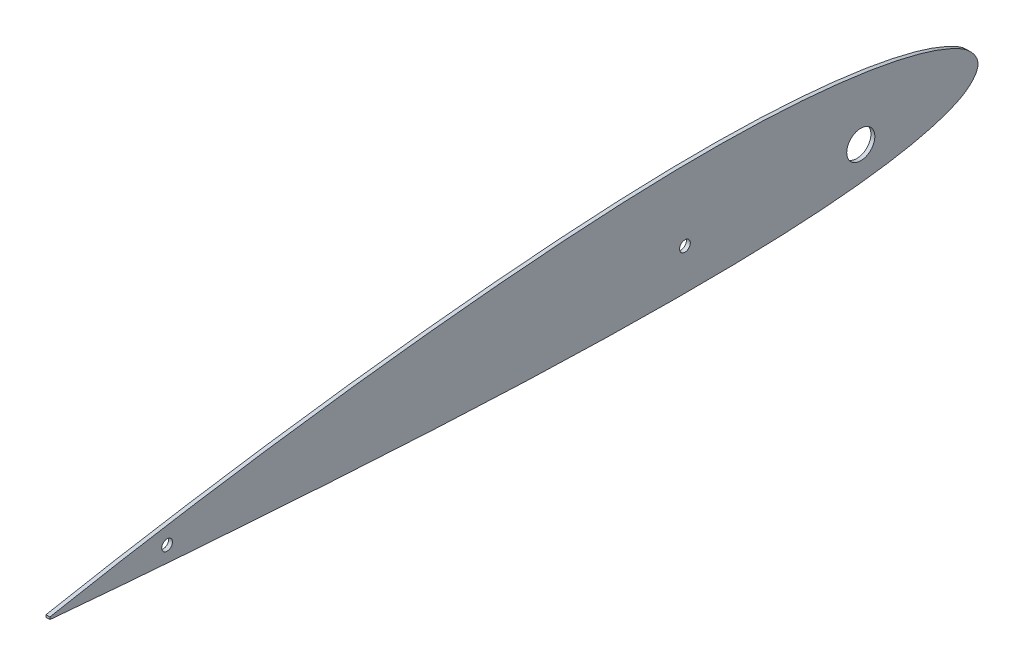
ISO-10303-21;
HEADER;
FILE_DESCRIPTION(('STEP AP214'),'2;1');
FILE_NAME('part.step','',(''),(''),'','','');
FILE_SCHEMA(('AUTOMOTIVE_DESIGN { 1 0 10303 214 1 1 1 1 }'));
ENDSEC;
DATA;
#1=APPLICATION_CONTEXT('core data for automotive mechanical design processes');
#2=APPLICATION_PROTOCOL_DEFINITION('international standard','automotive_design',2000,#1);
#3=PRODUCT_CONTEXT('',#1,'mechanical');
#4=PRODUCT('Part','Part','',(#3));
#5=PRODUCT_RELATED_PRODUCT_CATEGORY('part','',(#4));
#6=PRODUCT_DEFINITION_FORMATION('','',#4);
#7=PRODUCT_DEFINITION_CONTEXT('part definition',#1,'design');
#8=PRODUCT_DEFINITION('design','',#6,#7);
#9=PRODUCT_DEFINITION_SHAPE('','',#8);
#10=(LENGTH_UNIT() NAMED_UNIT(*) SI_UNIT(.MILLI.,.METRE.));
#11=(NAMED_UNIT(*) PLANE_ANGLE_UNIT() SI_UNIT($,.RADIAN.));
#12=(NAMED_UNIT(*) SI_UNIT($,.STERADIAN.) SOLID_ANGLE_UNIT());
#13=UNCERTAINTY_MEASURE_WITH_UNIT(LENGTH_MEASURE(1.E-05),#10,'distance_accuracy_value','');
#14=(GEOMETRIC_REPRESENTATION_CONTEXT(3) GLOBAL_UNCERTAINTY_ASSIGNED_CONTEXT((#13)) GLOBAL_UNIT_ASSIGNED_CONTEXT((#10,
#11,#12)) REPRESENTATION_CONTEXT('',''));
#15=CARTESIAN_POINT('',(0.,0.,0.));
#16=DIRECTION('',(0.,0.,1.));
#17=DIRECTION('',(1.,0.,0.));
#18=AXIS2_PLACEMENT_3D('',#15,#16,#17);
#19=CARTESIAN_POINT('',(2.,0.598497198061794,475.010074802855));
#20=CARTESIAN_POINT('',(2.,2.0790236287189,467.158690520784));
#21=CARTESIAN_POINT('',(2.,5.04046520752321,451.453860547719));
#22=CARTESIAN_POINT('',(2.,10.5303729676981,419.979582043477));
#23=CARTESIAN_POINT('',(2.,16.8373236789927,380.568519358802));
#24=CARTESIAN_POINT('',(2.,23.5016640304857,333.177066429499));
#25=CARTESIAN_POINT('',(2.,29.2721627629077,285.712995661429));
#26=CARTESIAN_POINT('',(2.,33.9707482150302,238.176447157113));
#27=CARTESIAN_POINT('',(2.,37.4185172913638,190.512569895496));
#28=CARTESIAN_POINT('',(2.,38.771778218813,150.679357097197));
#29=CARTESIAN_POINT('',(2.,38.4312492810106,118.758979212691));
#30=CARTESIAN_POINT('',(2.,37.3917675533514,94.8132002730884));
#31=CARTESIAN_POINT('',(2.,35.2890977949255,70.8709465141157));
#32=CARTESIAN_POINT('',(2.,32.4441637644638,50.9619868844845));
#33=CARTESIAN_POINT('',(2.,29.0608425273149,35.093906393071));
#34=CARTESIAN_POINT('',(2.,25.7786131745384,23.1483181376206));
#35=CARTESIAN_POINT('',(2.,21.7884828092321,13.1031754093609));
#36=CARTESIAN_POINT('',(2.,17.0044592579488,4.48816979284215));
#37=CARTESIAN_POINT('',(2.,7.90094705341297,-2.91234120427389));
#38=CARTESIAN_POINT('',(2.,-0.676100888636408,5.05216124977651));
#39=CARTESIAN_POINT('',(2.,-4.94658367346644,13.8832659371882));
#40=CARTESIAN_POINT('',(2.,-8.35498448423368,24.0571931578956));
#41=CARTESIAN_POINT('',(2.,-11.0298527935371,36.04230965412));
#42=CARTESIAN_POINT('',(2.,-13.6976980033518,51.8649255104538));
#43=CARTESIAN_POINT('',(2.,-15.8676272838065,71.6006452179179));
#44=CARTESIAN_POINT('',(2.,-17.4191085566015,95.2553331511756));
#45=CARTESIAN_POINT('',(2.,-18.2335362886324,118.863099098869));
#46=CARTESIAN_POINT('',(2.,-18.6213010186528,150.313877095147));
#47=CARTESIAN_POINT('',(2.,-18.1807835065514,189.707327800163));
#48=CARTESIAN_POINT('',(2.,-16.6534864273974,237.048964840664));
#49=CARTESIAN_POINT('',(2.,-14.3400470711003,284.501569815214));
#50=CARTESIAN_POINT('',(2.,-11.493536730421,332.013270591345));
#51=CARTESIAN_POINT('',(2.,-8.26585973787703,379.598404528134));
#52=CARTESIAN_POINT('',(2.,-5.27824397196585,419.295052652683));
#53=CARTESIAN_POINT('',(2.,-2.68922426390956,451.101430605551));
#54=CARTESIAN_POINT('',(2.,-1.29597982699712,467.020539675113));
#55=CARTESIAN_POINT('',(2.,-0.598497198061795,474.989925197145));
#56=B_SPLINE_CURVE_WITH_KNOTS('',3,(#19,#20,#21,#22,#23,#24,#25,#26,#27,#28,#29,#30,#31,#32,#33,
#34,#35,#36,#37,#38,#39,#40,#41,#42,#43,#44,#45,#46,#47,#48,#49,#50,#51,#52,#53,#54,#55),
.UNSPECIFIED.,.F.,.F.,(4,1,1,1,1,1,1,1,1,1,1,1,1,1,1,1,1,1,1,1,1,1,1,1,1,1,1,1,1,1,1,1,1,1,4),
(0.,0.0247583527022921,0.0495232057983208,0.099002464419805,0.148431640988793,0.197816092678823,
0.247156978041538,0.296440500967814,0.345884085447012,0.370605915917013,0.395346156344423,
0.420138805885135,0.4450560288657,0.457622030352105,0.470360866612067,0.483523326653886,
0.490626325383128,0.501772115898221,0.512907946738326,0.519977099804335,0.533052484339323,
0.545674076898575,0.558115541146016,0.58272509680566,0.607174358189599,0.631557278595084,
0.65591625667648,0.704636043070596,0.753621853029336,0.80268738739157,0.851851697592658,
0.901113053173649,0.950481472331415,0.975210155559022,1.),.UNSPECIFIED.);
#57=DIRECTION('',(-1.,0.,0.));
#58=VECTOR('',#57,1.);
#59=SURFACE_OF_LINEAR_EXTRUSION('',#56,#58);
#60=CARTESIAN_POINT('',(0.,0.598497198061794,475.010074802855));
#61=CARTESIAN_POINT('',(0.,2.0790236287189,467.158690520784));
#62=CARTESIAN_POINT('',(0.,5.04046520752321,451.453860547719));
#63=CARTESIAN_POINT('',(0.,10.5303729676981,419.979582043477));
#64=CARTESIAN_POINT('',(0.,16.8373236789927,380.568519358802));
#65=CARTESIAN_POINT('',(0.,23.5016640304857,333.177066429499));
#66=CARTESIAN_POINT('',(0.,29.2721627629077,285.712995661429));
#67=CARTESIAN_POINT('',(0.,33.9707482150302,238.176447157113));
#68=CARTESIAN_POINT('',(0.,37.4185172913638,190.512569895496));
#69=CARTESIAN_POINT('',(0.,38.771778218813,150.679357097197));
#70=CARTESIAN_POINT('',(0.,38.4312492810106,118.758979212691));
#71=CARTESIAN_POINT('',(0.,37.3917675533514,94.8132002730884));
#72=CARTESIAN_POINT('',(0.,35.2890977949255,70.8709465141157));
#73=CARTESIAN_POINT('',(0.,32.4441637644638,50.9619868844845));
#74=CARTESIAN_POINT('',(0.,29.0608425273149,35.093906393071));
#75=CARTESIAN_POINT('',(0.,25.7786131745384,23.1483181376206));
#76=CARTESIAN_POINT('',(0.,21.7884828092321,13.1031754093609));
#77=CARTESIAN_POINT('',(0.,17.0044592579488,4.48816979284215));
#78=CARTESIAN_POINT('',(0.,7.90094705341297,-2.91234120427389));
#79=CARTESIAN_POINT('',(0.,-0.676100888636408,5.05216124977651));
#80=CARTESIAN_POINT('',(0.,-4.94658367346644,13.8832659371882));
#81=CARTESIAN_POINT('',(0.,-8.35498448423368,24.0571931578956));
#82=CARTESIAN_POINT('',(0.,-11.0298527935371,36.04230965412));
#83=CARTESIAN_POINT('',(0.,-13.6976980033518,51.8649255104538));
#84=CARTESIAN_POINT('',(0.,-15.8676272838065,71.6006452179179));
#85=CARTESIAN_POINT('',(0.,-17.4191085566015,95.2553331511756));
#86=CARTESIAN_POINT('',(0.,-18.2335362886324,118.863099098869));
#87=CARTESIAN_POINT('',(0.,-18.6213010186528,150.313877095147));
#88=CARTESIAN_POINT('',(0.,-18.1807835065514,189.707327800163));
#89=CARTESIAN_POINT('',(0.,-16.6534864273974,237.048964840664));
#90=CARTESIAN_POINT('',(0.,-14.3400470711003,284.501569815214));
#91=CARTESIAN_POINT('',(0.,-11.493536730421,332.013270591345));
#92=CARTESIAN_POINT('',(0.,-8.26585973787703,379.598404528134));
#93=CARTESIAN_POINT('',(0.,-5.27824397196585,419.295052652683));
#94=CARTESIAN_POINT('',(0.,-2.68922426390956,451.101430605551));
#95=CARTESIAN_POINT('',(0.,-1.29597982699712,467.020539675113));
#96=CARTESIAN_POINT('',(0.,-0.598497198061795,474.989925197145));
#97=B_SPLINE_CURVE_WITH_KNOTS('',3,(#60,#61,#62,#63,#64,#65,#66,#67,#68,#69,#70,#71,#72,#73,#74,
#75,#76,#77,#78,#79,#80,#81,#82,#83,#84,#85,#86,#87,#88,#89,#90,#91,#92,#93,#94,#95,#96),
.UNSPECIFIED.,.F.,.F.,(4,1,1,1,1,1,1,1,1,1,1,1,1,1,1,1,1,1,1,1,1,1,1,1,1,1,1,1,1,1,1,1,1,1,4),
(0.,0.0247583527022921,0.0495232057983208,0.099002464419805,0.148431640988793,0.197816092678823,
0.247156978041538,0.296440500967814,0.345884085447012,0.370605915917013,0.395346156344423,
0.420138805885135,0.4450560288657,0.457622030352105,0.470360866612067,0.483523326653886,
0.490626325383128,0.501772115898221,0.512907946738326,0.519977099804335,0.533052484339323,
0.545674076898575,0.558115541146016,0.58272509680566,0.607174358189599,0.631557278595084,
0.65591625667648,0.704636043070596,0.753621853029336,0.80268738739157,0.851851697592658,
0.901113053173649,0.950481472331415,0.975210155559022,1.),.UNSPECIFIED.);
#98=CARTESIAN_POINT('',(0.,0.598497198061795,475.010074802855));
#99=VERTEX_POINT('',#98);
#100=CARTESIAN_POINT('',(0.,-0.598497198061795,474.989925197145));
#101=VERTEX_POINT('',#100);
#102=EDGE_CURVE('E67',#99,#101,#97,.T.);
#103=ORIENTED_EDGE('',*,*,#102,.F.);
#104=DIRECTION('',(-1.,0.,0.));
#105=VECTOR('',#104,1.);
#106=CARTESIAN_POINT('',(2.,0.598497198061795,475.010074802855));
#107=LINE('',#106,#105);
#108=CARTESIAN_POINT('',(2.,0.598497198061795,475.010074802855));
#109=VERTEX_POINT('',#108);
#110=EDGE_CURVE('E47',#109,#99,#107,.T.);
#111=ORIENTED_EDGE('',*,*,#110,.F.);
#112=CARTESIAN_POINT('',(2.,-0.598497198061795,474.989925197145));
#113=VERTEX_POINT('',#112);
#114=EDGE_CURVE('E68',#109,#113,#56,.T.);
#115=ORIENTED_EDGE('',*,*,#114,.T.);
#116=DIRECTION('',(-1.,0.,0.));
#117=VECTOR('',#116,1.);
#118=CARTESIAN_POINT('',(2.,-0.598497198061795,474.989925197145));
#119=LINE('',#118,#117);
#120=EDGE_CURVE('E11',#113,#101,#119,.T.);
#121=ORIENTED_EDGE('',*,*,#120,.T.);
#122=EDGE_LOOP('',(#103,#111,#115,#121));
#123=FACE_BOUND('',#122,.T.);
#124=ADVANCED_FACE('F37',(#123),#59,.T.);
#125=CARTESIAN_POINT('',(2.,0.598497198061795,475.010074802855));
#126=DIRECTION('',(0.,0.0168311159332721,-0.999858346735397));
#127=DIRECTION('',(0.,-0.999858346735397,-0.0168311159332722));
#128=AXIS2_PLACEMENT_3D('',#125,#126,#127);
#129=PLANE('',#128);
#130=DIRECTION('',(0.,0.999858346735397,0.0168311159332722));
#131=VECTOR('',#130,1.);
#132=CARTESIAN_POINT('',(0.,0.598497198061795,475.010074802855));
#133=LINE('',#132,#131);
#134=EDGE_CURVE('E62',#101,#99,#133,.T.);
#135=ORIENTED_EDGE('',*,*,#134,.F.);
#136=ORIENTED_EDGE('',*,*,#120,.F.);
#137=DIRECTION('',(0.,0.999858346735397,0.0168311159332722));
#138=VECTOR('',#137,1.);
#139=CARTESIAN_POINT('',(2.,0.598497198061795,475.010074802855));
#140=LINE('',#139,#138);
#141=EDGE_CURVE('E56',#113,#109,#140,.T.);
#142=ORIENTED_EDGE('',*,*,#141,.T.);
#143=ORIENTED_EDGE('',*,*,#110,.T.);
#144=EDGE_LOOP('',(#135,#136,#142,#143));
#145=FACE_BOUND('',#144,.T.);
#146=ADVANCED_FACE('F71',(#145),#129,.F.);
#147=CARTESIAN_POINT('',(2.,9.59888707137419,0.159864127170061));
#148=DIRECTION('',(-1.,0.,0.));
#149=DIRECTION('',(0.,0.,-1.));
#150=AXIS2_PLACEMENT_3D('',#147,#148,#149);
#151=PLANE('',#150);
#152=CARTESIAN_POINT('',(2.,2.5000018824215,60.));
#153=DIRECTION('',(-1.,0.,0.));
#154=DIRECTION('',(0.,0.,1.));
#155=AXIS2_PLACEMENT_3D('',#152,#153,#154);
#156=CIRCLE('',#155,7.19536101);
#157=CARTESIAN_POINT('',(2.,2.5000018824215,67.19536101));
#158=VERTEX_POINT('',#157);
#159=EDGE_CURVE('E87',#158,#158,#156,.T.);
#160=ORIENTED_EDGE('',*,*,#159,.T.);
#161=EDGE_LOOP('',(#160));
#162=FACE_BOUND('',#161,.T.);
#163=CARTESIAN_POINT('',(2.,2.5000018824215,150.));
#164=DIRECTION('',(-1.,0.,0.));
#165=DIRECTION('',(0.,0.,1.));
#166=AXIS2_PLACEMENT_3D('',#163,#164,#165);
#167=CIRCLE('',#166,2.75000000000001);
#168=CARTESIAN_POINT('',(2.,2.5000018824215,152.75));
#169=VERTEX_POINT('',#168);
#170=EDGE_CURVE('E101',#169,#169,#167,.T.);
#171=ORIENTED_EDGE('',*,*,#170,.T.);
#172=EDGE_LOOP('',(#171));
#173=FACE_BOUND('',#172,.T.);
#174=CARTESIAN_POINT('',(2.,2.50000188242148,415.033583382836));
#175=DIRECTION('',(-1.,0.,0.));
#176=DIRECTION('',(0.,0.,1.));
#177=AXIS2_PLACEMENT_3D('',#174,#175,#176);
#178=CIRCLE('',#177,2.75000000000004);
#179=CARTESIAN_POINT('',(2.,2.50000188242148,417.783583382836));
#180=VERTEX_POINT('',#179);
#181=EDGE_CURVE('E103',#180,#180,#178,.T.);
#182=ORIENTED_EDGE('',*,*,#181,.T.);
#183=EDGE_LOOP('',(#182));
#184=FACE_BOUND('',#183,.T.);
#185=ORIENTED_EDGE('',*,*,#114,.F.);
#186=ORIENTED_EDGE('',*,*,#141,.F.);
#187=EDGE_LOOP('',(#185,#186));
#188=FACE_BOUND('',#187,.T.);
#189=ADVANCED_FACE('F116',(#162,#173,#184,#188),#151,.F.);
#190=CARTESIAN_POINT('',(0.,9.59888707137419,0.159864127170061));
#191=DIRECTION('',(-1.,0.,0.));
#192=DIRECTION('',(0.,0.,-1.));
#193=AXIS2_PLACEMENT_3D('',#190,#191,#192);
#194=PLANE('',#193);
#195=CARTESIAN_POINT('',(0.,2.5000018824215,60.));
#196=DIRECTION('',(1.,0.,0.));
#197=DIRECTION('',(0.,0.,-1.));
#198=AXIS2_PLACEMENT_3D('',#195,#196,#197);
#199=CIRCLE('',#198,7.19536101);
#200=CARTESIAN_POINT('',(0.,2.5000018824215,67.19536101));
#201=VERTEX_POINT('',#200);
#202=EDGE_CURVE('E41',#201,#201,#199,.T.);
#203=ORIENTED_EDGE('',*,*,#202,.T.);
#204=EDGE_LOOP('',(#203));
#205=FACE_BOUND('',#204,.T.);
#206=CARTESIAN_POINT('',(0.,2.5000018824215,150.));
#207=DIRECTION('',(1.,0.,0.));
#208=DIRECTION('',(0.,0.,-1.));
#209=AXIS2_PLACEMENT_3D('',#206,#207,#208);
#210=CIRCLE('',#209,2.75000000000001);
#211=CARTESIAN_POINT('',(0.,2.5000018824215,152.75));
#212=VERTEX_POINT('',#211);
#213=EDGE_CURVE('E77',#212,#212,#210,.T.);
#214=ORIENTED_EDGE('',*,*,#213,.T.);
#215=EDGE_LOOP('',(#214));
#216=FACE_BOUND('',#215,.T.);
#217=CARTESIAN_POINT('',(0.,2.50000188242148,415.033583382836));
#218=DIRECTION('',(1.,0.,0.));
#219=DIRECTION('',(0.,0.,-1.));
#220=AXIS2_PLACEMENT_3D('',#217,#218,#219);
#221=CIRCLE('',#220,2.75000000000004);
#222=CARTESIAN_POINT('',(0.,2.50000188242148,417.783583382836));
#223=VERTEX_POINT('',#222);
#224=EDGE_CURVE('E85',#223,#223,#221,.T.);
#225=ORIENTED_EDGE('',*,*,#224,.T.);
#226=EDGE_LOOP('',(#225));
#227=FACE_BOUND('',#226,.T.);
#228=ORIENTED_EDGE('',*,*,#102,.T.);
#229=ORIENTED_EDGE('',*,*,#134,.T.);
#230=EDGE_LOOP('',(#228,#229));
#231=FACE_BOUND('',#230,.T.);
#232=ADVANCED_FACE('F65',(#205,#216,#227,#231),#194,.T.);
#233=CARTESIAN_POINT('',(-1.2E-05,2.50000188242148,415.033583382836));
#234=DIRECTION('',(1.,0.,0.));
#235=DIRECTION('',(0.,0.,1.));
#236=AXIS2_PLACEMENT_3D('',#233,#234,#235);
#237=CYLINDRICAL_SURFACE('',#236,2.75000000000004);
#238=CARTESIAN_POINT('',(0.,2.50000188242148,417.783583382836));
#239=CARTESIAN_POINT('',(0.0208333333333333,2.50000188242148,417.783583382836));
#240=CARTESIAN_POINT('',(0.0416666666666667,2.50000188242148,417.783583382836));
#241=CARTESIAN_POINT('',(0.0833333333333333,2.50000188242148,417.783583382836));
#242=CARTESIAN_POINT('',(0.104166666666667,2.50000188242148,417.783583382836));
#243=CARTESIAN_POINT('',(0.145833333333333,2.50000188242148,417.783583382836));
#244=CARTESIAN_POINT('',(0.166666666666667,2.50000188242148,417.783583382836));
#245=CARTESIAN_POINT('',(0.208333333333333,2.50000188242148,417.783583382836));
#246=CARTESIAN_POINT('',(0.229166666666667,2.50000188242148,417.783583382836));
#247=CARTESIAN_POINT('',(0.270833333333333,2.50000188242148,417.783583382836));
#248=CARTESIAN_POINT('',(0.291666666666667,2.50000188242148,417.783583382836));
#249=CARTESIAN_POINT('',(0.333333333333333,2.50000188242148,417.783583382836));
#250=CARTESIAN_POINT('',(0.354166666666667,2.50000188242148,417.783583382836));
#251=CARTESIAN_POINT('',(0.395833333333333,2.50000188242148,417.783583382836));
#252=CARTESIAN_POINT('',(0.416666666666667,2.50000188242148,417.783583382836));
#253=CARTESIAN_POINT('',(0.458333333333333,2.50000188242148,417.783583382836));
#254=CARTESIAN_POINT('',(0.479166666666667,2.50000188242148,417.783583382836));
#255=CARTESIAN_POINT('',(0.520833333333333,2.50000188242148,417.783583382836));
#256=CARTESIAN_POINT('',(0.541666666666667,2.50000188242148,417.783583382836));
#257=CARTESIAN_POINT('',(0.583333333333333,2.50000188242148,417.783583382836));
#258=CARTESIAN_POINT('',(0.604166666666667,2.50000188242148,417.783583382836));
#259=CARTESIAN_POINT('',(0.645833333333333,2.50000188242148,417.783583382836));
#260=CARTESIAN_POINT('',(0.666666666666667,2.50000188242148,417.783583382836));
#261=CARTESIAN_POINT('',(0.708333333333333,2.50000188242148,417.783583382836));
#262=CARTESIAN_POINT('',(0.729166666666667,2.50000188242148,417.783583382836));
#263=CARTESIAN_POINT('',(0.770833333333333,2.50000188242148,417.783583382836));
#264=CARTESIAN_POINT('',(0.791666666666667,2.50000188242148,417.783583382836));
#265=CARTESIAN_POINT('',(0.833333333333333,2.50000188242148,417.783583382836));
#266=CARTESIAN_POINT('',(0.854166666666667,2.50000188242148,417.783583382836));
#267=CARTESIAN_POINT('',(0.895833333333333,2.50000188242148,417.783583382836));
#268=CARTESIAN_POINT('',(0.916666666666667,2.50000188242148,417.783583382836));
#269=CARTESIAN_POINT('',(0.958333333333333,2.50000188242148,417.783583382836));
#270=CARTESIAN_POINT('',(0.979166666666667,2.50000188242148,417.783583382836));
#271=CARTESIAN_POINT('',(1.02083333333333,2.50000188242148,417.783583382836));
#272=CARTESIAN_POINT('',(1.04166666666667,2.50000188242148,417.783583382836));
#273=CARTESIAN_POINT('',(1.08333333333333,2.50000188242148,417.783583382836));
#274=CARTESIAN_POINT('',(1.10416666666667,2.50000188242148,417.783583382836));
#275=CARTESIAN_POINT('',(1.14583333333333,2.50000188242148,417.783583382836));
#276=CARTESIAN_POINT('',(1.16666666666667,2.50000188242148,417.783583382836));
#277=CARTESIAN_POINT('',(1.20833333333333,2.50000188242148,417.783583382836));
#278=CARTESIAN_POINT('',(1.22916666666667,2.50000188242148,417.783583382836));
#279=CARTESIAN_POINT('',(1.27083333333333,2.50000188242148,417.783583382836));
#280=CARTESIAN_POINT('',(1.29166666666667,2.50000188242148,417.783583382836));
#281=CARTESIAN_POINT('',(1.33333333333333,2.50000188242148,417.783583382836));
#282=CARTESIAN_POINT('',(1.35416666666667,2.50000188242148,417.783583382836));
#283=CARTESIAN_POINT('',(1.39583333333333,2.50000188242148,417.783583382836));
#284=CARTESIAN_POINT('',(1.41666666666667,2.50000188242148,417.783583382836));
#285=CARTESIAN_POINT('',(1.45833333333333,2.50000188242148,417.783583382836));
#286=CARTESIAN_POINT('',(1.47916666666667,2.50000188242148,417.783583382836));
#287=CARTESIAN_POINT('',(1.52083333333333,2.50000188242148,417.783583382836));
#288=CARTESIAN_POINT('',(1.54166666666667,2.50000188242148,417.783583382836));
#289=CARTESIAN_POINT('',(1.58333333333333,2.50000188242148,417.783583382836));
#290=CARTESIAN_POINT('',(1.60416666666667,2.50000188242148,417.783583382836));
#291=CARTESIAN_POINT('',(1.64583333333333,2.50000188242148,417.783583382836));
#292=CARTESIAN_POINT('',(1.66666666666667,2.50000188242148,417.783583382836));
#293=CARTESIAN_POINT('',(1.70833333333333,2.50000188242148,417.783583382836));
#294=CARTESIAN_POINT('',(1.72916666666667,2.50000188242148,417.783583382836));
#295=CARTESIAN_POINT('',(1.77083333333333,2.50000188242148,417.783583382836));
#296=CARTESIAN_POINT('',(1.79166666666667,2.50000188242148,417.783583382836));
#297=CARTESIAN_POINT('',(1.83333333333333,2.50000188242148,417.783583382836));
#298=CARTESIAN_POINT('',(1.85416666666667,2.50000188242148,417.783583382836));
#299=CARTESIAN_POINT('',(1.89583333333333,2.50000188242148,417.783583382836));
#300=CARTESIAN_POINT('',(1.91666666666667,2.50000188242148,417.783583382836));
#301=CARTESIAN_POINT('',(1.95833333333333,2.50000188242148,417.783583382836));
#302=CARTESIAN_POINT('',(1.97916666666667,2.50000188242148,417.783583382836));
#303=CARTESIAN_POINT('',(2.,2.50000188242148,417.783583382836));
#304=B_SPLINE_CURVE_WITH_KNOTS('',3,(#238,#239,#240,#241,#242,#243,#244,#245,#246,#247,#248,
#249,#250,#251,#252,#253,#254,#255,#256,#257,#258,#259,#260,#261,#262,#263,#264,#265,#266,#267,
#268,#269,#270,#271,#272,#273,#274,#275,#276,#277,#278,#279,#280,#281,#282,#283,#284,#285,#286,
#287,#288,#289,#290,#291,#292,#293,#294,#295,#296,#297,#298,#299,#300,#301,#302,#303),
.UNSPECIFIED.,.F.,.F.,(4,2,2,2,2,2,2,2,2,2,2,2,2,2,2,2,2,2,2,2,2,2,2,2,2,2,2,2,2,2,2,2,4),(0.,
0.0625,0.125,0.1875,0.25,0.3125,0.375,0.4375,0.5,0.5625,0.625,0.6875,0.75,0.8125,0.875,0.9375,
1.,1.0625,1.125,1.1875,1.25,1.3125,1.375,1.4375,1.5,1.5625,1.625,1.6875,1.75,1.8125,1.875,
1.9375,2.),.UNSPECIFIED.);
#305=EDGE_CURVE('BSEAM97',#223,#180,#304,.T.);
#306=ORIENTED_EDGE('',*,*,#224,.F.);
#307=ORIENTED_EDGE('',*,*,#181,.F.);
#308=ORIENTED_EDGE('',*,*,#305,.T.);
#309=ORIENTED_EDGE('',*,*,#305,.F.);
#310=EDGE_LOOP('',(#306,#308,#307,#309));
#311=FACE_BOUND('',#310,.T.);
#312=ADVANCED_FACE('F97',(#311),#237,.F.);
#313=CARTESIAN_POINT('',(-1.2E-05,2.5000018824215,150.));
#314=DIRECTION('',(1.,0.,0.));
#315=DIRECTION('',(0.,0.,1.));
#316=AXIS2_PLACEMENT_3D('',#313,#314,#315);
#317=CYLINDRICAL_SURFACE('',#316,2.75000000000001);
#318=CARTESIAN_POINT('',(0.,2.5000018824215,152.75));
#319=CARTESIAN_POINT('',(0.0208333333333333,2.5000018824215,152.75));
#320=CARTESIAN_POINT('',(0.0416666666666667,2.5000018824215,152.75));
#321=CARTESIAN_POINT('',(0.0833333333333333,2.5000018824215,152.75));
#322=CARTESIAN_POINT('',(0.104166666666667,2.5000018824215,152.75));
#323=CARTESIAN_POINT('',(0.145833333333333,2.5000018824215,152.75));
#324=CARTESIAN_POINT('',(0.166666666666667,2.5000018824215,152.75));
#325=CARTESIAN_POINT('',(0.208333333333333,2.5000018824215,152.75));
#326=CARTESIAN_POINT('',(0.229166666666667,2.5000018824215,152.75));
#327=CARTESIAN_POINT('',(0.270833333333333,2.5000018824215,152.75));
#328=CARTESIAN_POINT('',(0.291666666666667,2.5000018824215,152.75));
#329=CARTESIAN_POINT('',(0.333333333333333,2.5000018824215,152.75));
#330=CARTESIAN_POINT('',(0.354166666666667,2.5000018824215,152.75));
#331=CARTESIAN_POINT('',(0.395833333333333,2.5000018824215,152.75));
#332=CARTESIAN_POINT('',(0.416666666666667,2.5000018824215,152.75));
#333=CARTESIAN_POINT('',(0.458333333333333,2.5000018824215,152.75));
#334=CARTESIAN_POINT('',(0.479166666666667,2.5000018824215,152.75));
#335=CARTESIAN_POINT('',(0.520833333333333,2.5000018824215,152.75));
#336=CARTESIAN_POINT('',(0.541666666666667,2.5000018824215,152.75));
#337=CARTESIAN_POINT('',(0.583333333333333,2.5000018824215,152.75));
#338=CARTESIAN_POINT('',(0.604166666666667,2.5000018824215,152.75));
#339=CARTESIAN_POINT('',(0.645833333333333,2.5000018824215,152.75));
#340=CARTESIAN_POINT('',(0.666666666666667,2.5000018824215,152.75));
#341=CARTESIAN_POINT('',(0.708333333333333,2.5000018824215,152.75));
#342=CARTESIAN_POINT('',(0.729166666666667,2.5000018824215,152.75));
#343=CARTESIAN_POINT('',(0.770833333333333,2.5000018824215,152.75));
#344=CARTESIAN_POINT('',(0.791666666666667,2.5000018824215,152.75));
#345=CARTESIAN_POINT('',(0.833333333333333,2.5000018824215,152.75));
#346=CARTESIAN_POINT('',(0.854166666666667,2.5000018824215,152.75));
#347=CARTESIAN_POINT('',(0.895833333333333,2.5000018824215,152.75));
#348=CARTESIAN_POINT('',(0.916666666666667,2.5000018824215,152.75));
#349=CARTESIAN_POINT('',(0.958333333333333,2.5000018824215,152.75));
#350=CARTESIAN_POINT('',(0.979166666666667,2.5000018824215,152.75));
#351=CARTESIAN_POINT('',(1.02083333333333,2.5000018824215,152.75));
#352=CARTESIAN_POINT('',(1.04166666666667,2.5000018824215,152.75));
#353=CARTESIAN_POINT('',(1.08333333333333,2.5000018824215,152.75));
#354=CARTESIAN_POINT('',(1.10416666666667,2.5000018824215,152.75));
#355=CARTESIAN_POINT('',(1.14583333333333,2.5000018824215,152.75));
#356=CARTESIAN_POINT('',(1.16666666666667,2.5000018824215,152.75));
#357=CARTESIAN_POINT('',(1.20833333333333,2.5000018824215,152.75));
#358=CARTESIAN_POINT('',(1.22916666666667,2.5000018824215,152.75));
#359=CARTESIAN_POINT('',(1.27083333333333,2.5000018824215,152.75));
#360=CARTESIAN_POINT('',(1.29166666666667,2.5000018824215,152.75));
#361=CARTESIAN_POINT('',(1.33333333333333,2.5000018824215,152.75));
#362=CARTESIAN_POINT('',(1.35416666666667,2.5000018824215,152.75));
#363=CARTESIAN_POINT('',(1.39583333333333,2.5000018824215,152.75));
#364=CARTESIAN_POINT('',(1.41666666666667,2.5000018824215,152.75));
#365=CARTESIAN_POINT('',(1.45833333333333,2.5000018824215,152.75));
#366=CARTESIAN_POINT('',(1.47916666666667,2.5000018824215,152.75));
#367=CARTESIAN_POINT('',(1.52083333333333,2.5000018824215,152.75));
#368=CARTESIAN_POINT('',(1.54166666666667,2.5000018824215,152.75));
#369=CARTESIAN_POINT('',(1.58333333333333,2.5000018824215,152.75));
#370=CARTESIAN_POINT('',(1.60416666666667,2.5000018824215,152.75));
#371=CARTESIAN_POINT('',(1.64583333333333,2.5000018824215,152.75));
#372=CARTESIAN_POINT('',(1.66666666666667,2.5000018824215,152.75));
#373=CARTESIAN_POINT('',(1.70833333333333,2.5000018824215,152.75));
#374=CARTESIAN_POINT('',(1.72916666666667,2.5000018824215,152.75));
#375=CARTESIAN_POINT('',(1.77083333333333,2.5000018824215,152.75));
#376=CARTESIAN_POINT('',(1.79166666666667,2.5000018824215,152.75));
#377=CARTESIAN_POINT('',(1.83333333333333,2.5000018824215,152.75));
#378=CARTESIAN_POINT('',(1.85416666666667,2.5000018824215,152.75));
#379=CARTESIAN_POINT('',(1.89583333333333,2.5000018824215,152.75));
#380=CARTESIAN_POINT('',(1.91666666666667,2.5000018824215,152.75));
#381=CARTESIAN_POINT('',(1.95833333333333,2.5000018824215,152.75));
#382=CARTESIAN_POINT('',(1.97916666666667,2.5000018824215,152.75));
#383=CARTESIAN_POINT('',(2.,2.5000018824215,152.75));
#384=B_SPLINE_CURVE_WITH_KNOTS('',3,(#318,#319,#320,#321,#322,#323,#324,#325,#326,#327,#328,
#329,#330,#331,#332,#333,#334,#335,#336,#337,#338,#339,#340,#341,#342,#343,#344,#345,#346,#347,
#348,#349,#350,#351,#352,#353,#354,#355,#356,#357,#358,#359,#360,#361,#362,#363,#364,#365,#366,
#367,#368,#369,#370,#371,#372,#373,#374,#375,#376,#377,#378,#379,#380,#381,#382,#383),
.UNSPECIFIED.,.F.,.F.,(4,2,2,2,2,2,2,2,2,2,2,2,2,2,2,2,2,2,2,2,2,2,2,2,2,2,2,2,2,2,2,2,4),(0.,
0.0625,0.125,0.1875,0.25,0.3125,0.375,0.4375,0.5,0.5625,0.625,0.6875,0.75,0.8125,0.875,0.9375,
1.,1.0625,1.125,1.1875,1.25,1.3125,1.375,1.4375,1.5,1.5625,1.625,1.6875,1.75,1.8125,1.875,
1.9375,2.),.UNSPECIFIED.);
#385=EDGE_CURVE('BSEAM93',#212,#169,#384,.T.);
#386=ORIENTED_EDGE('',*,*,#213,.F.);
#387=ORIENTED_EDGE('',*,*,#170,.F.);
#388=ORIENTED_EDGE('',*,*,#385,.T.);
#389=ORIENTED_EDGE('',*,*,#385,.F.);
#390=EDGE_LOOP('',(#386,#388,#387,#389));
#391=FACE_BOUND('',#390,.T.);
#392=ADVANCED_FACE('F93',(#391),#317,.F.);
#393=CARTESIAN_POINT('',(-1.2E-05,2.5000018824215,60.));
#394=DIRECTION('',(1.,0.,0.));
#395=DIRECTION('',(0.,0.,1.));
#396=AXIS2_PLACEMENT_3D('',#393,#394,#395);
#397=CYLINDRICAL_SURFACE('',#396,7.19536101);
#398=CARTESIAN_POINT('',(0.,2.5000018824215,67.19536101));
#399=CARTESIAN_POINT('',(0.0208333333333333,2.5000018824215,67.19536101));
#400=CARTESIAN_POINT('',(0.0416666666666667,2.5000018824215,67.19536101));
#401=CARTESIAN_POINT('',(0.0833333333333333,2.5000018824215,67.19536101));
#402=CARTESIAN_POINT('',(0.104166666666667,2.5000018824215,67.19536101));
#403=CARTESIAN_POINT('',(0.145833333333333,2.5000018824215,67.19536101));
#404=CARTESIAN_POINT('',(0.166666666666667,2.5000018824215,67.19536101));
#405=CARTESIAN_POINT('',(0.208333333333333,2.5000018824215,67.19536101));
#406=CARTESIAN_POINT('',(0.229166666666667,2.5000018824215,67.19536101));
#407=CARTESIAN_POINT('',(0.270833333333333,2.5000018824215,67.19536101));
#408=CARTESIAN_POINT('',(0.291666666666667,2.5000018824215,67.19536101));
#409=CARTESIAN_POINT('',(0.333333333333333,2.5000018824215,67.19536101));
#410=CARTESIAN_POINT('',(0.354166666666667,2.5000018824215,67.19536101));
#411=CARTESIAN_POINT('',(0.395833333333333,2.5000018824215,67.19536101));
#412=CARTESIAN_POINT('',(0.416666666666667,2.5000018824215,67.19536101));
#413=CARTESIAN_POINT('',(0.458333333333333,2.5000018824215,67.19536101));
#414=CARTESIAN_POINT('',(0.479166666666667,2.5000018824215,67.19536101));
#415=CARTESIAN_POINT('',(0.520833333333333,2.5000018824215,67.19536101));
#416=CARTESIAN_POINT('',(0.541666666666667,2.5000018824215,67.19536101));
#417=CARTESIAN_POINT('',(0.583333333333333,2.5000018824215,67.19536101));
#418=CARTESIAN_POINT('',(0.604166666666667,2.5000018824215,67.19536101));
#419=CARTESIAN_POINT('',(0.645833333333333,2.5000018824215,67.19536101));
#420=CARTESIAN_POINT('',(0.666666666666667,2.5000018824215,67.19536101));
#421=CARTESIAN_POINT('',(0.708333333333333,2.5000018824215,67.19536101));
#422=CARTESIAN_POINT('',(0.729166666666667,2.5000018824215,67.19536101));
#423=CARTESIAN_POINT('',(0.770833333333333,2.5000018824215,67.19536101));
#424=CARTESIAN_POINT('',(0.791666666666667,2.5000018824215,67.19536101));
#425=CARTESIAN_POINT('',(0.833333333333333,2.5000018824215,67.19536101));
#426=CARTESIAN_POINT('',(0.854166666666667,2.5000018824215,67.19536101));
#427=CARTESIAN_POINT('',(0.895833333333333,2.5000018824215,67.19536101));
#428=CARTESIAN_POINT('',(0.916666666666667,2.5000018824215,67.19536101));
#429=CARTESIAN_POINT('',(0.958333333333333,2.5000018824215,67.19536101));
#430=CARTESIAN_POINT('',(0.979166666666667,2.5000018824215,67.19536101));
#431=CARTESIAN_POINT('',(1.02083333333333,2.5000018824215,67.19536101));
#432=CARTESIAN_POINT('',(1.04166666666667,2.5000018824215,67.19536101));
#433=CARTESIAN_POINT('',(1.08333333333333,2.5000018824215,67.19536101));
#434=CARTESIAN_POINT('',(1.10416666666667,2.5000018824215,67.19536101));
#435=CARTESIAN_POINT('',(1.14583333333333,2.5000018824215,67.19536101));
#436=CARTESIAN_POINT('',(1.16666666666667,2.5000018824215,67.19536101));
#437=CARTESIAN_POINT('',(1.20833333333333,2.5000018824215,67.19536101));
#438=CARTESIAN_POINT('',(1.22916666666667,2.5000018824215,67.19536101));
#439=CARTESIAN_POINT('',(1.27083333333333,2.5000018824215,67.19536101));
#440=CARTESIAN_POINT('',(1.29166666666667,2.5000018824215,67.19536101));
#441=CARTESIAN_POINT('',(1.33333333333333,2.5000018824215,67.19536101));
#442=CARTESIAN_POINT('',(1.35416666666667,2.5000018824215,67.19536101));
#443=CARTESIAN_POINT('',(1.39583333333333,2.5000018824215,67.19536101));
#444=CARTESIAN_POINT('',(1.41666666666667,2.5000018824215,67.19536101));
#445=CARTESIAN_POINT('',(1.45833333333333,2.5000018824215,67.19536101));
#446=CARTESIAN_POINT('',(1.47916666666667,2.5000018824215,67.19536101));
#447=CARTESIAN_POINT('',(1.52083333333333,2.5000018824215,67.19536101));
#448=CARTESIAN_POINT('',(1.54166666666667,2.5000018824215,67.19536101));
#449=CARTESIAN_POINT('',(1.58333333333333,2.5000018824215,67.19536101));
#450=CARTESIAN_POINT('',(1.60416666666667,2.5000018824215,67.19536101));
#451=CARTESIAN_POINT('',(1.64583333333333,2.5000018824215,67.19536101));
#452=CARTESIAN_POINT('',(1.66666666666667,2.5000018824215,67.19536101));
#453=CARTESIAN_POINT('',(1.70833333333333,2.5000018824215,67.19536101));
#454=CARTESIAN_POINT('',(1.72916666666667,2.5000018824215,67.19536101));
#455=CARTESIAN_POINT('',(1.77083333333333,2.5000018824215,67.19536101));
#456=CARTESIAN_POINT('',(1.79166666666667,2.5000018824215,67.19536101));
#457=CARTESIAN_POINT('',(1.83333333333333,2.5000018824215,67.19536101));
#458=CARTESIAN_POINT('',(1.85416666666667,2.5000018824215,67.19536101));
#459=CARTESIAN_POINT('',(1.89583333333333,2.5000018824215,67.19536101));
#460=CARTESIAN_POINT('',(1.91666666666667,2.5000018824215,67.19536101));
#461=CARTESIAN_POINT('',(1.95833333333333,2.5000018824215,67.19536101));
#462=CARTESIAN_POINT('',(1.97916666666667,2.5000018824215,67.19536101));
#463=CARTESIAN_POINT('',(2.,2.5000018824215,67.19536101));
#464=B_SPLINE_CURVE_WITH_KNOTS('',3,(#398,#399,#400,#401,#402,#403,#404,#405,#406,#407,#408,
#409,#410,#411,#412,#413,#414,#415,#416,#417,#418,#419,#420,#421,#422,#423,#424,#425,#426,#427,
#428,#429,#430,#431,#432,#433,#434,#435,#436,#437,#438,#439,#440,#441,#442,#443,#444,#445,#446,
#447,#448,#449,#450,#451,#452,#453,#454,#455,#456,#457,#458,#459,#460,#461,#462,#463),
.UNSPECIFIED.,.F.,.F.,(4,2,2,2,2,2,2,2,2,2,2,2,2,2,2,2,2,2,2,2,2,2,2,2,2,2,2,2,2,2,2,2,4),(0.,
0.0625,0.125,0.1875,0.25,0.3125,0.375,0.4375,0.5,0.5625,0.625,0.6875,0.75,0.8125,0.875,0.9375,
1.,1.0625,1.125,1.1875,1.25,1.3125,1.375,1.4375,1.5,1.5625,1.625,1.6875,1.75,1.8125,1.875,
1.9375,2.),.UNSPECIFIED.);
#465=EDGE_CURVE('BSEAM96',#201,#158,#464,.T.);
#466=ORIENTED_EDGE('',*,*,#202,.F.);
#467=ORIENTED_EDGE('',*,*,#159,.F.);
#468=ORIENTED_EDGE('',*,*,#465,.T.);
#469=ORIENTED_EDGE('',*,*,#465,.F.);
#470=EDGE_LOOP('',(#466,#468,#467,#469));
#471=FACE_BOUND('',#470,.T.);
#472=ADVANCED_FACE('F96',(#471),#397,.F.);
#473=CLOSED_SHELL('',(#124,#146,#189,#232,#312,#392,#472));
#474=MANIFOLD_SOLID_BREP('B2',#473);
#475=ADVANCED_BREP_SHAPE_REPRESENTATION('',(#18,#474),#14);
#476=SHAPE_DEFINITION_REPRESENTATION(#9,#475);
ENDSEC;
END-ISO-10303-21;
